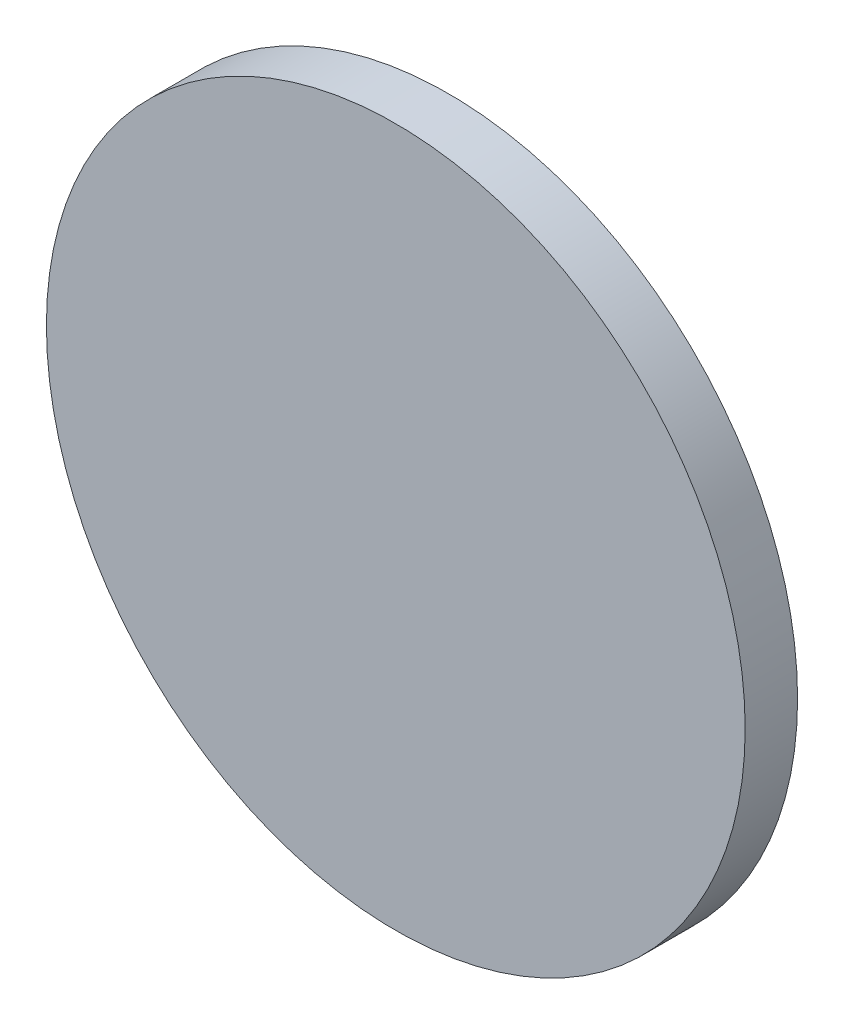
ISO-10303-21;
HEADER;
FILE_DESCRIPTION(('STEP AP214'),'2;1');
FILE_NAME('part.step','',(''),(''),'','','');
FILE_SCHEMA(('AUTOMOTIVE_DESIGN { 1 0 10303 214 1 1 1 1 }'));
ENDSEC;
DATA;
#1=APPLICATION_CONTEXT('core data for automotive mechanical design processes');
#2=APPLICATION_PROTOCOL_DEFINITION('international standard','automotive_design',2000,#1);
#3=PRODUCT_CONTEXT('',#1,'mechanical');
#4=PRODUCT('Part','Part','',(#3));
#5=PRODUCT_RELATED_PRODUCT_CATEGORY('part','',(#4));
#6=PRODUCT_DEFINITION_FORMATION('','',#4);
#7=PRODUCT_DEFINITION_CONTEXT('part definition',#1,'design');
#8=PRODUCT_DEFINITION('design','',#6,#7);
#9=PRODUCT_DEFINITION_SHAPE('','',#8);
#10=(LENGTH_UNIT() NAMED_UNIT(*) SI_UNIT(.MILLI.,.METRE.));
#11=(NAMED_UNIT(*) PLANE_ANGLE_UNIT() SI_UNIT($,.RADIAN.));
#12=(NAMED_UNIT(*) SI_UNIT($,.STERADIAN.) SOLID_ANGLE_UNIT());
#13=UNCERTAINTY_MEASURE_WITH_UNIT(LENGTH_MEASURE(1.E-05),#10,'distance_accuracy_value','');
#14=(GEOMETRIC_REPRESENTATION_CONTEXT(3) GLOBAL_UNCERTAINTY_ASSIGNED_CONTEXT((#13)) GLOBAL_UNIT_ASSIGNED_CONTEXT((#10,
#11,#12)) REPRESENTATION_CONTEXT('',''));
#15=CARTESIAN_POINT('',(0.,0.,0.));
#16=DIRECTION('',(0.,0.,1.));
#17=DIRECTION('',(1.,0.,0.));
#18=AXIS2_PLACEMENT_3D('',#15,#16,#17);
#19=CARTESIAN_POINT('',(8.34916,13.13491,0.));
#20=DIRECTION('',(0.,0.,-1.));
#21=DIRECTION('',(-1.,0.,0.));
#22=AXIS2_PLACEMENT_3D('',#19,#20,#21);
#23=PLANE('',#22);
#24=CARTESIAN_POINT('',(8.34916,13.13491,0.));
#25=DIRECTION('',(0.,0.,1.));
#26=DIRECTION('',(1.,0.,0.));
#27=AXIS2_PLACEMENT_3D('',#24,#25,#26);
#28=CIRCLE('',#27,0.2286);
#29=CARTESIAN_POINT('',(8.57776,13.13491,0.));
#30=VERTEX_POINT('',#29);
#31=EDGE_CURVE('E18',#30,#30,#28,.T.);
#32=ORIENTED_EDGE('',*,*,#31,.F.);
#33=EDGE_LOOP('',(#32));
#34=FACE_BOUND('',#33,.T.);
#35=ADVANCED_FACE('F15',(#34),#23,.T.);
#36=CARTESIAN_POINT('',(8.34916,13.13491,0.));
#37=DIRECTION('',(0.,0.,1.));
#38=DIRECTION('',(1.,0.,0.));
#39=AXIS2_PLACEMENT_3D('',#36,#37,#38);
#40=CYLINDRICAL_SURFACE('',#39,0.2286);
#41=CARTESIAN_POINT('',(8.34916,13.13491,0.03429));
#42=DIRECTION('',(0.,0.,1.));
#43=DIRECTION('',(1.,0.,0.));
#44=AXIS2_PLACEMENT_3D('',#41,#42,#43);
#45=CIRCLE('',#44,0.2286);
#46=CARTESIAN_POINT('',(8.57776,13.13491,0.03429));
#47=VERTEX_POINT('',#46);
#48=EDGE_CURVE('E10',#47,#47,#45,.T.);
#49=ORIENTED_EDGE('',*,*,#48,.F.);
#50=EDGE_LOOP('',(#49));
#51=FACE_BOUND('',#50,.T.);
#52=ORIENTED_EDGE('',*,*,#31,.T.);
#53=EDGE_LOOP('',(#52));
#54=FACE_BOUND('',#53,.T.);
#55=ADVANCED_FACE('F27',(#51,#54),#40,.T.);
#56=CARTESIAN_POINT('',(8.34916,13.13491,0.03429));
#57=DIRECTION('',(0.,0.,1.));
#58=DIRECTION('',(1.,0.,0.));
#59=AXIS2_PLACEMENT_3D('',#56,#57,#58);
#60=PLANE('',#59);
#61=ORIENTED_EDGE('',*,*,#48,.T.);
#62=EDGE_LOOP('',(#61));
#63=FACE_BOUND('',#62,.T.);
#64=ADVANCED_FACE('F34',(#63),#60,.T.);
#65=CLOSED_SHELL('',(#35,#55,#64));
#66=MANIFOLD_SOLID_BREP('B1',#65);
#67=ADVANCED_BREP_SHAPE_REPRESENTATION('',(#18,#66),#14);
#68=SHAPE_DEFINITION_REPRESENTATION(#9,#67);
ENDSEC;
END-ISO-10303-21;
